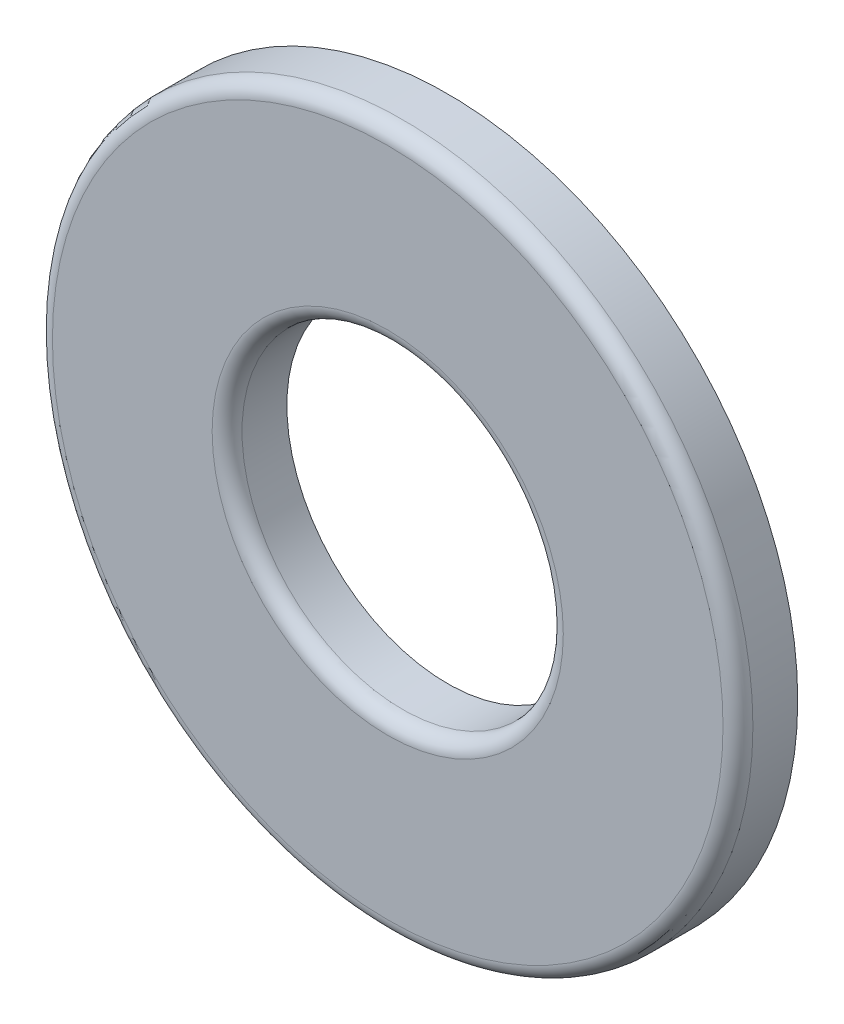
ISO-10303-21;
HEADER;
FILE_DESCRIPTION(('STEP AP214'),'2;1');
FILE_NAME('part.step','',(''),(''),'','','');
FILE_SCHEMA(('AUTOMOTIVE_DESIGN { 1 0 10303 214 1 1 1 1 }'));
ENDSEC;
DATA;
#1=APPLICATION_CONTEXT('core data for automotive mechanical design processes');
#2=APPLICATION_PROTOCOL_DEFINITION('international standard','automotive_design',2000,#1);
#3=PRODUCT_CONTEXT('',#1,'mechanical');
#4=PRODUCT('Part','Part','',(#3));
#5=PRODUCT_RELATED_PRODUCT_CATEGORY('part','',(#4));
#6=PRODUCT_DEFINITION_FORMATION('','',#4);
#7=PRODUCT_DEFINITION_CONTEXT('part definition',#1,'design');
#8=PRODUCT_DEFINITION('design','',#6,#7);
#9=PRODUCT_DEFINITION_SHAPE('','',#8);
#10=(LENGTH_UNIT() NAMED_UNIT(*) SI_UNIT(.MILLI.,.METRE.));
#11=(NAMED_UNIT(*) PLANE_ANGLE_UNIT() SI_UNIT($,.RADIAN.));
#12=(NAMED_UNIT(*) SI_UNIT($,.STERADIAN.) SOLID_ANGLE_UNIT());
#13=UNCERTAINTY_MEASURE_WITH_UNIT(LENGTH_MEASURE(1.E-05),#10,'distance_accuracy_value','');
#14=(GEOMETRIC_REPRESENTATION_CONTEXT(3) GLOBAL_UNCERTAINTY_ASSIGNED_CONTEXT((#13)) GLOBAL_UNIT_ASSIGNED_CONTEXT((#10,
#11,#12)) REPRESENTATION_CONTEXT('',''));
#15=CARTESIAN_POINT('',(0.,0.,0.));
#16=DIRECTION('',(0.,0.,1.));
#17=DIRECTION('',(1.,0.,0.));
#18=AXIS2_PLACEMENT_3D('',#15,#16,#17);
#19=CARTESIAN_POINT('',(0.,0.,0.406399999999997));
#20=DIRECTION('',(0.,0.,1.));
#21=DIRECTION('',(1.,0.,0.));
#22=AXIS2_PLACEMENT_3D('',#19,#20,#21);
#23=PLANE('',#22);
#24=CARTESIAN_POINT('',(0.,0.,0.406399999999997));
#25=DIRECTION('',(0.,0.,1.));
#26=DIRECTION('',(1.,0.,0.));
#27=AXIS2_PLACEMENT_3D('',#24,#25,#26);
#28=CIRCLE('',#27,4.5593);
#29=CARTESIAN_POINT('',(4.5593,0.,0.406399999999997));
#30=VERTEX_POINT('',#29);
#31=EDGE_CURVE('E56',#30,#30,#28,.T.);
#32=ORIENTED_EDGE('',*,*,#31,.T.);
#33=EDGE_LOOP('',(#32));
#34=FACE_BOUND('',#33,.T.);
#35=CARTESIAN_POINT('',(0.,0.,0.406399999999997));
#36=DIRECTION('',(0.,0.,1.));
#37=DIRECTION('',(1.,0.,0.));
#38=AXIS2_PLACEMENT_3D('',#35,#36,#37);
#39=CIRCLE('',#38,2.3876);
#40=CARTESIAN_POINT('',(2.3876,0.,0.406399999999997));
#41=VERTEX_POINT('',#40);
#42=EDGE_CURVE('E61',#41,#41,#39,.F.);
#43=ORIENTED_EDGE('',*,*,#42,.T.);
#44=EDGE_LOOP('',(#43));
#45=FACE_BOUND('',#44,.T.);
#46=ADVANCED_FACE('F43',(#34,#45),#23,.T.);
#47=CARTESIAN_POINT('',(0.,0.,0.406399999999997));
#48=DIRECTION('',(0.,0.,-1.));
#49=DIRECTION('',(-1.,0.,0.));
#50=AXIS2_PLACEMENT_3D('',#47,#48,#49);
#51=CYLINDRICAL_SURFACE('',#50,4.7625);
#52=CARTESIAN_POINT('',(0.,0.,0.203199999999997));
#53=DIRECTION('',(0.,0.,1.));
#54=DIRECTION('',(1.,0.,0.));
#55=AXIS2_PLACEMENT_3D('',#52,#53,#54);
#56=CIRCLE('',#55,4.7625);
#57=CARTESIAN_POINT('',(4.7625,0.,0.203199999999997));
#58=VERTEX_POINT('',#57);
#59=EDGE_CURVE('E51',#58,#58,#56,.F.);
#60=ORIENTED_EDGE('',*,*,#59,.T.);
#61=EDGE_LOOP('',(#60));
#62=FACE_BOUND('',#61,.T.);
#63=CARTESIAN_POINT('',(0.,0.,-0.406400000000003));
#64=DIRECTION('',(0.,0.,1.));
#65=DIRECTION('',(1.,0.,0.));
#66=AXIS2_PLACEMENT_3D('',#63,#64,#65);
#67=CIRCLE('',#66,4.7625);
#68=CARTESIAN_POINT('',(4.7625,0.,-0.406400000000003));
#69=VERTEX_POINT('',#68);
#70=EDGE_CURVE('E67',#69,#69,#67,.T.);
#71=ORIENTED_EDGE('',*,*,#70,.T.);
#72=EDGE_LOOP('',(#71));
#73=FACE_BOUND('',#72,.T.);
#74=ADVANCED_FACE('F81',(#62,#73),#51,.T.);
#75=CARTESIAN_POINT('',(0.,0.,0.406399999999997));
#76=DIRECTION('',(0.,0.,-1.));
#77=DIRECTION('',(-1.,0.,0.));
#78=AXIS2_PLACEMENT_3D('',#75,#76,#77);
#79=CYLINDRICAL_SURFACE('',#78,2.1844);
#80=CARTESIAN_POINT('',(0.,0.,0.203199999999997));
#81=DIRECTION('',(0.,0.,1.));
#82=DIRECTION('',(1.,0.,0.));
#83=AXIS2_PLACEMENT_3D('',#80,#81,#82);
#84=CIRCLE('',#83,2.1844);
#85=CARTESIAN_POINT('',(2.1844,0.,0.203199999999997));
#86=VERTEX_POINT('',#85);
#87=EDGE_CURVE('E10',#86,#86,#84,.T.);
#88=ORIENTED_EDGE('',*,*,#87,.T.);
#89=EDGE_LOOP('',(#88));
#90=FACE_BOUND('',#89,.T.);
#91=CARTESIAN_POINT('',(0.,0.,-0.406400000000003));
#92=DIRECTION('',(0.,0.,1.));
#93=DIRECTION('',(1.,0.,0.));
#94=AXIS2_PLACEMENT_3D('',#91,#92,#93);
#95=CIRCLE('',#94,2.1844);
#96=CARTESIAN_POINT('',(2.1844,0.,-0.406400000000003));
#97=VERTEX_POINT('',#96);
#98=EDGE_CURVE('E71',#97,#97,#95,.T.);
#99=ORIENTED_EDGE('',*,*,#98,.F.);
#100=EDGE_LOOP('',(#99));
#101=FACE_BOUND('',#100,.T.);
#102=ADVANCED_FACE('F79',(#90,#101),#79,.F.);
#103=CARTESIAN_POINT('',(0.,0.,-0.406400000000003));
#104=DIRECTION('',(0.,0.,1.));
#105=DIRECTION('',(1.,0.,0.));
#106=AXIS2_PLACEMENT_3D('',#103,#104,#105);
#107=PLANE('',#106);
#108=ORIENTED_EDGE('',*,*,#98,.T.);
#109=EDGE_LOOP('',(#108));
#110=FACE_BOUND('',#109,.T.);
#111=ORIENTED_EDGE('',*,*,#70,.F.);
#112=EDGE_LOOP('',(#111));
#113=FACE_BOUND('',#112,.T.);
#114=ADVANCED_FACE('F76',(#110,#113),#107,.F.);
#115=CARTESIAN_POINT('',(0.,0.,0.203199999999997));
#116=DIRECTION('',(0.,0.,1.));
#117=DIRECTION('',(1.,0.,0.));
#118=AXIS2_PLACEMENT_3D('',#115,#116,#117);
#119=TOROIDAL_SURFACE('',#118,4.5593,0.2032);
#120=ORIENTED_EDGE('',*,*,#59,.F.);
#121=EDGE_LOOP('',(#120));
#122=FACE_BOUND('',#121,.T.);
#123=ORIENTED_EDGE('',*,*,#31,.F.);
#124=EDGE_LOOP('',(#123));
#125=FACE_BOUND('',#124,.T.);
#126=ADVANCED_FACE('F88',(#122,#125),#119,.T.);
#127=CARTESIAN_POINT('',(0.,0.,0.203199999999997));
#128=DIRECTION('',(0.,0.,1.));
#129=DIRECTION('',(1.,0.,0.));
#130=AXIS2_PLACEMENT_3D('',#127,#128,#129);
#131=TOROIDAL_SURFACE('',#130,2.3876,0.2032);
#132=ORIENTED_EDGE('',*,*,#42,.F.);
#133=EDGE_LOOP('',(#132));
#134=FACE_BOUND('',#133,.T.);
#135=ORIENTED_EDGE('',*,*,#87,.F.);
#136=EDGE_LOOP('',(#135));
#137=FACE_BOUND('',#136,.T.);
#138=ADVANCED_FACE('F45',(#134,#137),#131,.T.);
#139=CLOSED_SHELL('',(#46,#74,#102,#114,#126,#138));
#140=MANIFOLD_SOLID_BREP('B2',#139);
#141=ADVANCED_BREP_SHAPE_REPRESENTATION('',(#18,#140),#14);
#142=SHAPE_DEFINITION_REPRESENTATION(#9,#141);
ENDSEC;
END-ISO-10303-21;
